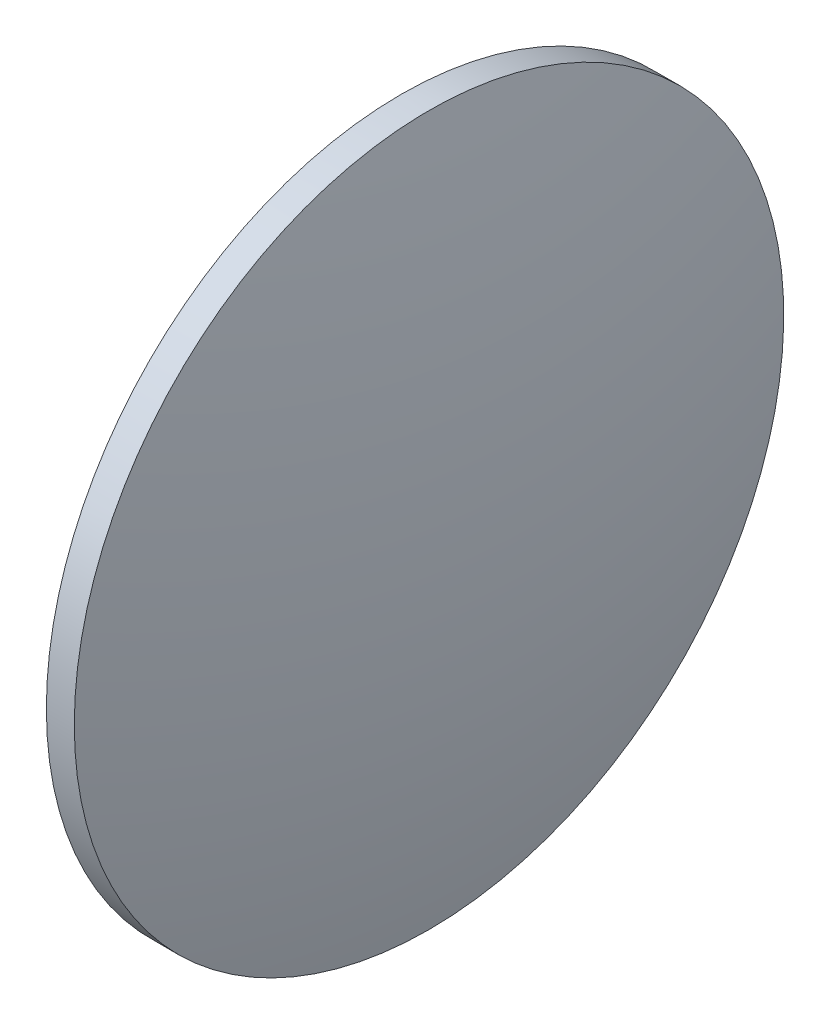
ISO-10303-21;
HEADER;
FILE_DESCRIPTION(('STEP AP214'),'2;1');
FILE_NAME('part.step','',(''),(''),'','','');
FILE_SCHEMA(('AUTOMOTIVE_DESIGN { 1 0 10303 214 1 1 1 1 }'));
ENDSEC;
DATA;
#1=APPLICATION_CONTEXT('core data for automotive mechanical design processes');
#2=APPLICATION_PROTOCOL_DEFINITION('international standard','automotive_design',2000,#1);
#3=PRODUCT_CONTEXT('',#1,'mechanical');
#4=PRODUCT('Part','Part','',(#3));
#5=PRODUCT_RELATED_PRODUCT_CATEGORY('part','',(#4));
#6=PRODUCT_DEFINITION_FORMATION('','',#4);
#7=PRODUCT_DEFINITION_CONTEXT('part definition',#1,'design');
#8=PRODUCT_DEFINITION('design','',#6,#7);
#9=PRODUCT_DEFINITION_SHAPE('','',#8);
#10=(LENGTH_UNIT() NAMED_UNIT(*) SI_UNIT(.MILLI.,.METRE.));
#11=(NAMED_UNIT(*) PLANE_ANGLE_UNIT() SI_UNIT($,.RADIAN.));
#12=(NAMED_UNIT(*) SI_UNIT($,.STERADIAN.) SOLID_ANGLE_UNIT());
#13=UNCERTAINTY_MEASURE_WITH_UNIT(LENGTH_MEASURE(1.E-05),#10,'distance_accuracy_value','');
#14=(GEOMETRIC_REPRESENTATION_CONTEXT(3) GLOBAL_UNCERTAINTY_ASSIGNED_CONTEXT((#13)) GLOBAL_UNIT_ASSIGNED_CONTEXT((#10,
#11,#12)) REPRESENTATION_CONTEXT('',''));
#15=CARTESIAN_POINT('',(0.,0.,0.));
#16=DIRECTION('',(0.,0.,1.));
#17=DIRECTION('',(1.,0.,0.));
#18=AXIS2_PLACEMENT_3D('',#15,#16,#17);
#19=CARTESIAN_POINT('',(139.709280480732,48.6161130231847,0.));
#20=DIRECTION('',(-1.,0.,0.));
#21=DIRECTION('',(0.,1.,0.));
#22=AXIS2_PLACEMENT_3D('',#19,#20,#21);
#23=SPHERICAL_SURFACE('',#22,55.2310529917842);
#24=CARTESIAN_POINT('',(85.9581947746625,48.6161130231848,0.));
#25=DIRECTION('',(-1.,0.,0.));
#26=DIRECTION('',(0.,0.,1.));
#27=AXIS2_PLACEMENT_3D('',#24,#25,#26);
#28=CIRCLE('',#27,12.7);
#29=CARTESIAN_POINT('',(85.9581947746625,48.6161130231848,12.7));
#30=VERTEX_POINT('',#29);
#31=EDGE_CURVE('E46',#30,#30,#28,.T.);
#32=ORIENTED_EDGE('',*,*,#31,.T.);
#33=EDGE_LOOP('',(#32));
#34=FACE_BOUND('',#33,.T.);
#35=ADVANCED_FACE('F39',(#34),#23,.T.);
#36=CARTESIAN_POINT('',(33.207107068593,48.6161130231848,0.));
#37=DIRECTION('',(-1.,0.,0.));
#38=DIRECTION('',(0.,-1.,0.));
#39=AXIS2_PLACEMENT_3D('',#36,#37,#38);
#40=SPHERICAL_SURFACE('',#39,55.2310529917839);
#41=CARTESIAN_POINT('',(86.9581927746625,48.6161130231848,0.));
#42=DIRECTION('',(-1.,0.,0.));
#43=DIRECTION('',(0.,0.,1.));
#44=AXIS2_PLACEMENT_3D('',#41,#42,#43);
#45=CIRCLE('',#44,12.7);
#46=CARTESIAN_POINT('',(86.9581927746625,48.6161130231848,12.7));
#47=VERTEX_POINT('',#46);
#48=EDGE_CURVE('E10',#47,#47,#45,.T.);
#49=ORIENTED_EDGE('',*,*,#48,.F.);
#50=EDGE_LOOP('',(#49));
#51=FACE_BOUND('',#50,.T.);
#52=ADVANCED_FACE('F56',(#51),#40,.T.);
#53=CARTESIAN_POINT('',(79.3054013508372,48.6161130231848,0.));
#54=DIRECTION('',(-1.,0.,0.));
#55=DIRECTION('',(0.,0.,1.));
#56=AXIS2_PLACEMENT_3D('',#53,#54,#55);
#57=CYLINDRICAL_SURFACE('',#56,12.7);
#58=ORIENTED_EDGE('',*,*,#48,.T.);
#59=EDGE_LOOP('',(#58));
#60=FACE_BOUND('',#59,.T.);
#61=ORIENTED_EDGE('',*,*,#31,.F.);
#62=EDGE_LOOP('',(#61));
#63=FACE_BOUND('',#62,.T.);
#64=ADVANCED_FACE('F54',(#60,#63),#57,.T.);
#65=CLOSED_SHELL('',(#35,#52,#64));
#66=MANIFOLD_SOLID_BREP('B2',#65);
#67=ADVANCED_BREP_SHAPE_REPRESENTATION('',(#18,#66),#14);
#68=SHAPE_DEFINITION_REPRESENTATION(#9,#67);
ENDSEC;
END-ISO-10303-21;
